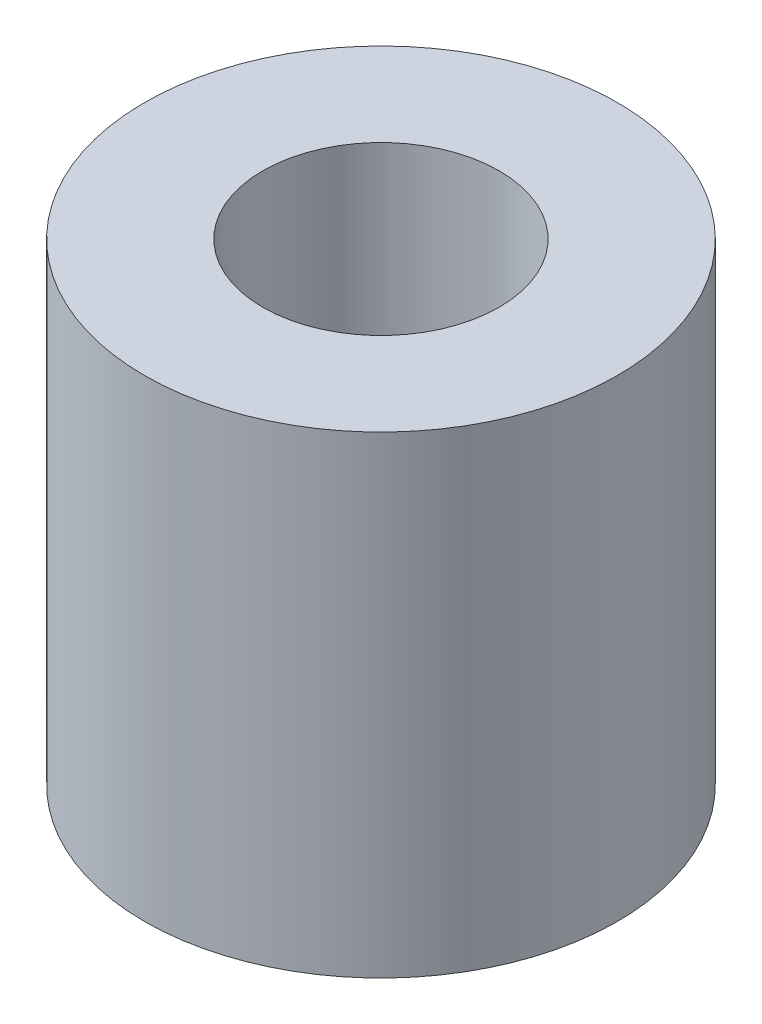
ISO-10303-21;
HEADER;
FILE_DESCRIPTION(('STEP AP214'),'2;1');
FILE_NAME('part.step','',(''),(''),'','','');
FILE_SCHEMA(('AUTOMOTIVE_DESIGN { 1 0 10303 214 1 1 1 1 }'));
ENDSEC;
DATA;
#1=APPLICATION_CONTEXT('core data for automotive mechanical design processes');
#2=APPLICATION_PROTOCOL_DEFINITION('international standard','automotive_design',2000,#1);
#3=PRODUCT_CONTEXT('',#1,'mechanical');
#4=PRODUCT('Part','Part','',(#3));
#5=PRODUCT_RELATED_PRODUCT_CATEGORY('part','',(#4));
#6=PRODUCT_DEFINITION_FORMATION('','',#4);
#7=PRODUCT_DEFINITION_CONTEXT('part definition',#1,'design');
#8=PRODUCT_DEFINITION('design','',#6,#7);
#9=PRODUCT_DEFINITION_SHAPE('','',#8);
#10=(LENGTH_UNIT() NAMED_UNIT(*) SI_UNIT(.MILLI.,.METRE.));
#11=(NAMED_UNIT(*) PLANE_ANGLE_UNIT() SI_UNIT($,.RADIAN.));
#12=(NAMED_UNIT(*) SI_UNIT($,.STERADIAN.) SOLID_ANGLE_UNIT());
#13=UNCERTAINTY_MEASURE_WITH_UNIT(LENGTH_MEASURE(1.E-05),#10,'distance_accuracy_value','');
#14=(GEOMETRIC_REPRESENTATION_CONTEXT(3) GLOBAL_UNCERTAINTY_ASSIGNED_CONTEXT((#13)) GLOBAL_UNIT_ASSIGNED_CONTEXT((#10,
#11,#12)) REPRESENTATION_CONTEXT('',''));
#15=CARTESIAN_POINT('',(0.,0.,0.));
#16=DIRECTION('',(0.,0.,1.));
#17=DIRECTION('',(1.,0.,0.));
#18=AXIS2_PLACEMENT_3D('',#15,#16,#17);
#19=CARTESIAN_POINT('',(0.,6.35,0.));
#20=DIRECTION('',(0.,1.,0.));
#21=DIRECTION('',(0.,0.,1.));
#22=AXIS2_PLACEMENT_3D('',#19,#20,#21);
#23=PLANE('',#22);
#24=CARTESIAN_POINT('',(0.,6.35,0.));
#25=DIRECTION('',(0.,1.,0.));
#26=DIRECTION('',(0.,0.,1.));
#27=AXIS2_PLACEMENT_3D('',#24,#25,#26);
#28=CIRCLE('',#27,3.175);
#29=CARTESIAN_POINT('',(0.,6.35,3.175));
#30=VERTEX_POINT('',#29);
#31=EDGE_CURVE('E10',#30,#30,#28,.T.);
#32=ORIENTED_EDGE('',*,*,#31,.T.);
#33=EDGE_LOOP('',(#32));
#34=FACE_BOUND('',#33,.T.);
#35=CARTESIAN_POINT('',(0.,6.35,0.));
#36=DIRECTION('',(0.,1.,0.));
#37=DIRECTION('',(0.,0.,1.));
#38=AXIS2_PLACEMENT_3D('',#35,#36,#37);
#39=CIRCLE('',#38,1.5875);
#40=CARTESIAN_POINT('',(0.,6.35,1.5875));
#41=VERTEX_POINT('',#40);
#42=EDGE_CURVE('E40',#41,#41,#39,.T.);
#43=ORIENTED_EDGE('',*,*,#42,.F.);
#44=EDGE_LOOP('',(#43));
#45=FACE_BOUND('',#44,.T.);
#46=ADVANCED_FACE('F29',(#34,#45),#23,.T.);
#47=CARTESIAN_POINT('',(0.,0.,0.));
#48=DIRECTION('',(0.,1.,0.));
#49=DIRECTION('',(0.,0.,1.));
#50=AXIS2_PLACEMENT_3D('',#47,#48,#49);
#51=PLANE('',#50);
#52=CARTESIAN_POINT('',(0.,0.,0.));
#53=DIRECTION('',(0.,1.,0.));
#54=DIRECTION('',(0.,0.,1.));
#55=AXIS2_PLACEMENT_3D('',#52,#53,#54);
#56=CIRCLE('',#55,3.175);
#57=CARTESIAN_POINT('',(0.,0.,3.175));
#58=VERTEX_POINT('',#57);
#59=EDGE_CURVE('E33',#58,#58,#56,.T.);
#60=ORIENTED_EDGE('',*,*,#59,.F.);
#61=EDGE_LOOP('',(#60));
#62=FACE_BOUND('',#61,.T.);
#63=CARTESIAN_POINT('',(0.,0.,0.));
#64=DIRECTION('',(0.,1.,0.));
#65=DIRECTION('',(0.,0.,1.));
#66=AXIS2_PLACEMENT_3D('',#63,#64,#65);
#67=CIRCLE('',#66,1.5875);
#68=CARTESIAN_POINT('',(0.,0.,1.5875));
#69=VERTEX_POINT('',#68);
#70=EDGE_CURVE('E42',#69,#69,#67,.T.);
#71=ORIENTED_EDGE('',*,*,#70,.T.);
#72=EDGE_LOOP('',(#71));
#73=FACE_BOUND('',#72,.T.);
#74=ADVANCED_FACE('F52',(#62,#73),#51,.F.);
#75=CARTESIAN_POINT('',(0.,6.35,0.));
#76=DIRECTION('',(0.,-1.,0.));
#77=DIRECTION('',(0.,0.,-1.));
#78=AXIS2_PLACEMENT_3D('',#75,#76,#77);
#79=CYLINDRICAL_SURFACE('',#78,3.175);
#80=ORIENTED_EDGE('',*,*,#31,.F.);
#81=EDGE_LOOP('',(#80));
#82=FACE_BOUND('',#81,.T.);
#83=ORIENTED_EDGE('',*,*,#59,.T.);
#84=EDGE_LOOP('',(#83));
#85=FACE_BOUND('',#84,.T.);
#86=ADVANCED_FACE('F31',(#82,#85),#79,.T.);
#87=CARTESIAN_POINT('',(0.,6.35,0.));
#88=DIRECTION('',(0.,-1.,0.));
#89=DIRECTION('',(0.,0.,-1.));
#90=AXIS2_PLACEMENT_3D('',#87,#88,#89);
#91=CYLINDRICAL_SURFACE('',#90,1.5875);
#92=ORIENTED_EDGE('',*,*,#42,.T.);
#93=EDGE_LOOP('',(#92));
#94=FACE_BOUND('',#93,.T.);
#95=ORIENTED_EDGE('',*,*,#70,.F.);
#96=EDGE_LOOP('',(#95));
#97=FACE_BOUND('',#96,.T.);
#98=ADVANCED_FACE('F48',(#94,#97),#91,.F.);
#99=CLOSED_SHELL('',(#46,#74,#86,#98));
#100=MANIFOLD_SOLID_BREP('B2',#99);
#101=ADVANCED_BREP_SHAPE_REPRESENTATION('',(#18,#100),#14);
#102=SHAPE_DEFINITION_REPRESENTATION(#9,#101);
ENDSEC;
END-ISO-10303-21;
